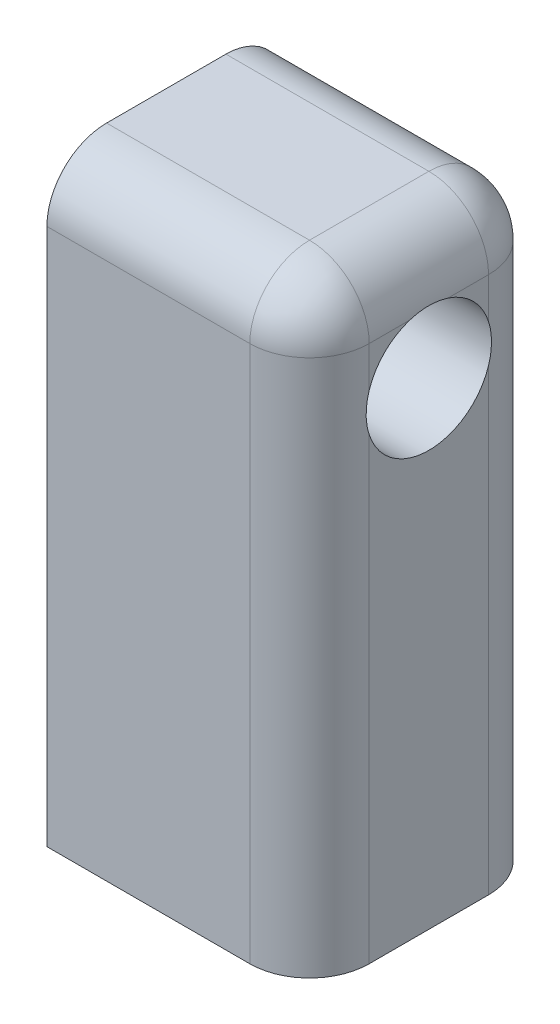
ISO-10303-21;
HEADER;
FILE_DESCRIPTION(('STEP AP214'),'2;1');
FILE_NAME('part.step','',(''),(''),'','','');
FILE_SCHEMA(('AUTOMOTIVE_DESIGN { 1 0 10303 214 1 1 1 1 }'));
ENDSEC;
DATA;
#1=APPLICATION_CONTEXT('core data for automotive mechanical design processes');
#2=APPLICATION_PROTOCOL_DEFINITION('international standard','automotive_design',2000,#1);
#3=PRODUCT_CONTEXT('',#1,'mechanical');
#4=PRODUCT('Part','Part','',(#3));
#5=PRODUCT_RELATED_PRODUCT_CATEGORY('part','',(#4));
#6=PRODUCT_DEFINITION_FORMATION('','',#4);
#7=PRODUCT_DEFINITION_CONTEXT('part definition',#1,'design');
#8=PRODUCT_DEFINITION('design','',#6,#7);
#9=PRODUCT_DEFINITION_SHAPE('','',#8);
#10=(LENGTH_UNIT() NAMED_UNIT(*) SI_UNIT(.MILLI.,.METRE.));
#11=(NAMED_UNIT(*) PLANE_ANGLE_UNIT() SI_UNIT($,.RADIAN.));
#12=(NAMED_UNIT(*) SI_UNIT($,.STERADIAN.) SOLID_ANGLE_UNIT());
#13=UNCERTAINTY_MEASURE_WITH_UNIT(LENGTH_MEASURE(1.E-05),#10,'distance_accuracy_value','');
#14=(GEOMETRIC_REPRESENTATION_CONTEXT(3) GLOBAL_UNCERTAINTY_ASSIGNED_CONTEXT((#13)) GLOBAL_UNIT_ASSIGNED_CONTEXT((#10,
#11,#12)) REPRESENTATION_CONTEXT('',''));
#15=CARTESIAN_POINT('',(0.,0.,0.));
#16=DIRECTION('',(0.,0.,1.));
#17=DIRECTION('',(1.,0.,0.));
#18=AXIS2_PLACEMENT_3D('',#15,#16,#17);
#19=CARTESIAN_POINT('',(4.4,10.,0.));
#20=DIRECTION('',(-1.,0.,0.));
#21=DIRECTION('',(0.,0.,1.));
#22=AXIS2_PLACEMENT_3D('',#19,#20,#21);
#23=PLANE('',#22);
#24=DIRECTION('',(0.,-1.,0.));
#25=VECTOR('',#24,1.);
#26=CARTESIAN_POINT('',(4.4,10.,-1.));
#27=LINE('',#26,#25);
#28=CARTESIAN_POINT('',(4.4,9.,-1.));
#29=VERTEX_POINT('',#28);
#30=CARTESIAN_POINT('',(4.4,8.32015621187164,-1.));
#31=VERTEX_POINT('',#30);
#32=EDGE_CURVE('E163',#29,#31,#27,.T.);
#33=ORIENTED_EDGE('',*,*,#32,.T.);
#34=CARTESIAN_POINT('',(4.4,8.,-2.));
#35=DIRECTION('',(1.,0.,0.));
#36=DIRECTION('',(0.,0.,-1.));
#37=AXIS2_PLACEMENT_3D('',#34,#35,#36);
#38=CIRCLE('',#37,1.05);
#39=CARTESIAN_POINT('',(4.4,9.,-1.67984378812836));
#40=VERTEX_POINT('',#39);
#41=EDGE_CURVE('E62',#40,#31,#38,.T.);
#42=ORIENTED_EDGE('',*,*,#41,.F.);
#43=DIRECTION('',(0.,0.,-1.));
#44=VECTOR('',#43,1.);
#45=CARTESIAN_POINT('',(4.4,9.,0.));
#46=LINE('',#45,#44);
#47=EDGE_CURVE('E160',#40,#29,#46,.F.);
#48=ORIENTED_EDGE('',*,*,#47,.T.);
#49=EDGE_LOOP('',(#33,#42,#48));
#50=FACE_BOUND('',#49,.T.);
#51=ADVANCED_FACE('F45',(#50),#23,.F.);
#52=CARTESIAN_POINT('',(4.4,9.,-3.));
#53=VERTEX_POINT('',#52);
#54=CARTESIAN_POINT('',(4.4,9.,-2.32015621187164));
#55=VERTEX_POINT('',#54);
#56=EDGE_CURVE('E148',#53,#55,#46,.F.);
#57=ORIENTED_EDGE('',*,*,#56,.T.);
#58=CARTESIAN_POINT('',(4.4,8.32015621187164,-3.));
#59=VERTEX_POINT('',#58);
#60=EDGE_CURVE('E133',#59,#55,#38,.T.);
#61=ORIENTED_EDGE('',*,*,#60,.F.);
#62=DIRECTION('',(0.,-1.,0.));
#63=VECTOR('',#62,1.);
#64=CARTESIAN_POINT('',(4.4,10.,-3.));
#65=LINE('',#64,#63);
#66=EDGE_CURVE('E49',#59,#53,#65,.F.);
#67=ORIENTED_EDGE('',*,*,#66,.T.);
#68=EDGE_LOOP('',(#57,#61,#67));
#69=FACE_BOUND('',#68,.T.);
#70=ADVANCED_FACE('F146',(#69),#23,.F.);
#71=CARTESIAN_POINT('',(0.,10.,0.));
#72=DIRECTION('',(1.,0.,0.));
#73=DIRECTION('',(0.,0.,-1.));
#74=AXIS2_PLACEMENT_3D('',#71,#72,#73);
#75=PLANE('',#74);
#76=CARTESIAN_POINT('',(0.,8.,-2.));
#77=DIRECTION('',(1.,0.,0.));
#78=DIRECTION('',(0.,0.,-1.));
#79=AXIS2_PLACEMENT_3D('',#76,#77,#78);
#80=CIRCLE('',#79,1.05);
#81=CARTESIAN_POINT('',(0.,8.,-3.05));
#82=VERTEX_POINT('',#81);
#83=EDGE_CURVE('E142',#82,#82,#80,.T.);
#84=ORIENTED_EDGE('',*,*,#83,.T.);
#85=EDGE_LOOP('',(#84));
#86=FACE_BOUND('',#85,.T.);
#87=DIRECTION('',(0.,-1.,0.));
#88=VECTOR('',#87,1.);
#89=CARTESIAN_POINT('',(0.,10.,0.));
#90=LINE('',#89,#88);
#91=CARTESIAN_POINT('',(0.,9.,0.));
#92=VERTEX_POINT('',#91);
#93=CARTESIAN_POINT('',(0.,0.,0.));
#94=VERTEX_POINT('',#93);
#95=EDGE_CURVE('E299',#92,#94,#90,.T.);
#96=ORIENTED_EDGE('',*,*,#95,.F.);
#97=CARTESIAN_POINT('',(0.,9.,-1.));
#98=DIRECTION('',(1.,0.,0.));
#99=DIRECTION('',(0.,0.,-1.));
#100=AXIS2_PLACEMENT_3D('',#97,#98,#99);
#101=CIRCLE('',#100,1.);
#102=CARTESIAN_POINT('',(0.,10.,-1.));
#103=VERTEX_POINT('',#102);
#104=EDGE_CURVE('E321',#92,#103,#101,.F.);
#105=ORIENTED_EDGE('',*,*,#104,.T.);
#106=DIRECTION('',(0.,0.,1.));
#107=VECTOR('',#106,1.);
#108=CARTESIAN_POINT('',(0.,10.,0.));
#109=LINE('',#108,#107);
#110=CARTESIAN_POINT('',(0.,10.,-3.));
#111=VERTEX_POINT('',#110);
#112=EDGE_CURVE('E277',#111,#103,#109,.T.);
#113=ORIENTED_EDGE('',*,*,#112,.F.);
#114=CARTESIAN_POINT('',(0.,9.,-3.));
#115=DIRECTION('',(1.,0.,0.));
#116=DIRECTION('',(0.,0.,-1.));
#117=AXIS2_PLACEMENT_3D('',#114,#115,#116);
#118=CIRCLE('',#117,1.);
#119=CARTESIAN_POINT('',(0.,9.,-4.));
#120=VERTEX_POINT('',#119);
#121=EDGE_CURVE('E318',#111,#120,#118,.F.);
#122=ORIENTED_EDGE('',*,*,#121,.T.);
#123=DIRECTION('',(0.,-1.,0.));
#124=VECTOR('',#123,1.);
#125=CARTESIAN_POINT('',(0.,10.,-4.));
#126=LINE('',#125,#124);
#127=CARTESIAN_POINT('',(0.,0.,-4.));
#128=VERTEX_POINT('',#127);
#129=EDGE_CURVE('E281',#120,#128,#126,.T.);
#130=ORIENTED_EDGE('',*,*,#129,.T.);
#131=DIRECTION('',(0.,0.,1.));
#132=VECTOR('',#131,1.);
#133=CARTESIAN_POINT('',(0.,0.,0.));
#134=LINE('',#133,#132);
#135=EDGE_CURVE('E271',#128,#94,#134,.T.);
#136=ORIENTED_EDGE('',*,*,#135,.T.);
#137=EDGE_LOOP('',(#96,#105,#113,#122,#130,#136));
#138=FACE_BOUND('',#137,.T.);
#139=ADVANCED_FACE('F381',(#86,#138),#75,.F.);
#140=CARTESIAN_POINT('',(0.,10.,0.));
#141=DIRECTION('',(0.,0.,-1.));
#142=DIRECTION('',(-1.,0.,0.));
#143=AXIS2_PLACEMENT_3D('',#140,#141,#142);
#144=PLANE('',#143);
#145=DIRECTION('',(0.,-1.,0.));
#146=VECTOR('',#145,1.);
#147=CARTESIAN_POINT('',(3.4,10.,0.));
#148=LINE('',#147,#146);
#149=CARTESIAN_POINT('',(3.4,0.,0.));
#150=VERTEX_POINT('',#149);
#151=CARTESIAN_POINT('',(3.4,9.,0.));
#152=VERTEX_POINT('',#151);
#153=EDGE_CURVE('E312',#150,#152,#148,.F.);
#154=ORIENTED_EDGE('',*,*,#153,.T.);
#155=DIRECTION('',(1.,0.,0.));
#156=VECTOR('',#155,1.);
#157=CARTESIAN_POINT('',(0.,9.,0.));
#158=LINE('',#157,#156);
#159=EDGE_CURVE('E315',#152,#92,#158,.F.);
#160=ORIENTED_EDGE('',*,*,#159,.T.);
#161=ORIENTED_EDGE('',*,*,#95,.T.);
#162=DIRECTION('',(1.,0.,0.));
#163=VECTOR('',#162,1.);
#164=CARTESIAN_POINT('',(0.,0.,0.));
#165=LINE('',#164,#163);
#166=EDGE_CURVE('E286',#94,#150,#165,.T.);
#167=ORIENTED_EDGE('',*,*,#166,.T.);
#168=EDGE_LOOP('',(#154,#160,#161,#167));
#169=FACE_BOUND('',#168,.T.);
#170=ADVANCED_FACE('F366',(#169),#144,.F.);
#171=CARTESIAN_POINT('',(4.4,0.,-3.));
#172=VERTEX_POINT('',#171);
#173=CARTESIAN_POINT('',(4.4,7.67984378812836,-3.));
#174=VERTEX_POINT('',#173);
#175=EDGE_CURVE('E156',#172,#174,#65,.F.);
#176=ORIENTED_EDGE('',*,*,#175,.T.);
#177=CARTESIAN_POINT('',(4.4,7.67984378812836,-1.));
#178=VERTEX_POINT('',#177);
#179=EDGE_CURVE('E136',#178,#174,#38,.T.);
#180=ORIENTED_EDGE('',*,*,#179,.F.);
#181=CARTESIAN_POINT('',(4.4,0.,-1.));
#182=VERTEX_POINT('',#181);
#183=EDGE_CURVE('E220',#178,#182,#27,.T.);
#184=ORIENTED_EDGE('',*,*,#183,.T.);
#185=DIRECTION('',(0.,0.,-1.));
#186=VECTOR('',#185,1.);
#187=CARTESIAN_POINT('',(4.4,0.,0.));
#188=LINE('',#187,#186);
#189=EDGE_CURVE('E290',#182,#172,#188,.T.);
#190=ORIENTED_EDGE('',*,*,#189,.T.);
#191=EDGE_LOOP('',(#176,#180,#184,#190));
#192=FACE_BOUND('',#191,.T.);
#193=ADVANCED_FACE('F390',(#192),#23,.F.);
#194=CARTESIAN_POINT('',(0.,10.,-4.));
#195=DIRECTION('',(0.,0.,1.));
#196=DIRECTION('',(1.,0.,0.));
#197=AXIS2_PLACEMENT_3D('',#194,#195,#196);
#198=PLANE('',#197);
#199=ORIENTED_EDGE('',*,*,#129,.F.);
#200=DIRECTION('',(-1.,0.,0.));
#201=VECTOR('',#200,1.);
#202=CARTESIAN_POINT('',(0.,9.,-4.));
#203=LINE('',#202,#201);
#204=CARTESIAN_POINT('',(3.4,9.,-4.));
#205=VERTEX_POINT('',#204);
#206=EDGE_CURVE('E222',#120,#205,#203,.F.);
#207=ORIENTED_EDGE('',*,*,#206,.T.);
#208=DIRECTION('',(0.,-1.,0.));
#209=VECTOR('',#208,1.);
#210=CARTESIAN_POINT('',(3.4,10.,-4.));
#211=LINE('',#210,#209);
#212=CARTESIAN_POINT('',(3.4,0.,-4.));
#213=VERTEX_POINT('',#212);
#214=EDGE_CURVE('E324',#205,#213,#211,.T.);
#215=ORIENTED_EDGE('',*,*,#214,.T.);
#216=DIRECTION('',(-1.,0.,0.));
#217=VECTOR('',#216,1.);
#218=CARTESIAN_POINT('',(0.,0.,-4.));
#219=LINE('',#218,#217);
#220=EDGE_CURVE('E282',#213,#128,#219,.T.);
#221=ORIENTED_EDGE('',*,*,#220,.T.);
#222=EDGE_LOOP('',(#199,#207,#215,#221));
#223=FACE_BOUND('',#222,.T.);
#224=ADVANCED_FACE('F330',(#223),#198,.F.);
#225=CARTESIAN_POINT('',(0.,10.,0.));
#226=DIRECTION('',(0.,-1.,0.));
#227=DIRECTION('',(0.,0.,-1.));
#228=AXIS2_PLACEMENT_3D('',#225,#226,#227);
#229=PLANE('',#228);
#230=ORIENTED_EDGE('',*,*,#112,.T.);
#231=DIRECTION('',(1.,0.,0.));
#232=VECTOR('',#231,1.);
#233=CARTESIAN_POINT('',(0.,10.,-1.));
#234=LINE('',#233,#232);
#235=CARTESIAN_POINT('',(3.4,10.,-1.));
#236=VERTEX_POINT('',#235);
#237=EDGE_CURVE('E308',#103,#236,#234,.T.);
#238=ORIENTED_EDGE('',*,*,#237,.T.);
#239=DIRECTION('',(0.,0.,-1.));
#240=VECTOR('',#239,1.);
#241=CARTESIAN_POINT('',(3.4,10.,0.));
#242=LINE('',#241,#240);
#243=CARTESIAN_POINT('',(3.4,10.,-3.));
#244=VERTEX_POINT('',#243);
#245=EDGE_CURVE('E302',#236,#244,#242,.T.);
#246=ORIENTED_EDGE('',*,*,#245,.T.);
#247=DIRECTION('',(-1.,0.,0.));
#248=VECTOR('',#247,1.);
#249=CARTESIAN_POINT('',(0.,10.,-3.));
#250=LINE('',#249,#248);
#251=EDGE_CURVE('E305',#244,#111,#250,.T.);
#252=ORIENTED_EDGE('',*,*,#251,.T.);
#253=EDGE_LOOP('',(#230,#238,#246,#252));
#254=FACE_BOUND('',#253,.T.);
#255=ADVANCED_FACE('F378',(#254),#229,.F.);
#256=CARTESIAN_POINT('',(0.,0.,0.));
#257=DIRECTION('',(0.,-1.,0.));
#258=DIRECTION('',(0.,0.,-1.));
#259=AXIS2_PLACEMENT_3D('',#256,#257,#258);
#260=PLANE('',#259);
#261=CARTESIAN_POINT('',(2.4,0.,-2.));
#262=DIRECTION('',(0.,-1.,0.));
#263=DIRECTION('',(0.,0.,-1.));
#264=AXIS2_PLACEMENT_3D('',#261,#262,#263);
#265=CIRCLE('',#264,0.925);
#266=CARTESIAN_POINT('',(2.4,0.,-2.925));
#267=VERTEX_POINT('',#266);
#268=EDGE_CURVE('E272',#267,#267,#265,.T.);
#269=ORIENTED_EDGE('',*,*,#268,.F.);
#270=EDGE_LOOP('',(#269));
#271=FACE_BOUND('',#270,.T.);
#272=ORIENTED_EDGE('',*,*,#220,.F.);
#273=CARTESIAN_POINT('',(3.4,0.,-3.));
#274=DIRECTION('',(0.,-1.,0.));
#275=DIRECTION('',(0.,0.,-1.));
#276=AXIS2_PLACEMENT_3D('',#273,#274,#275);
#277=CIRCLE('',#276,1.);
#278=EDGE_CURVE('E56',#213,#172,#277,.T.);
#279=ORIENTED_EDGE('',*,*,#278,.T.);
#280=ORIENTED_EDGE('',*,*,#189,.F.);
#281=CARTESIAN_POINT('',(3.4,0.,-1.));
#282=DIRECTION('',(0.,-1.,0.));
#283=DIRECTION('',(0.,0.,-1.));
#284=AXIS2_PLACEMENT_3D('',#281,#282,#283);
#285=CIRCLE('',#284,1.);
#286=EDGE_CURVE('E159',#182,#150,#285,.T.);
#287=ORIENTED_EDGE('',*,*,#286,.T.);
#288=ORIENTED_EDGE('',*,*,#166,.F.);
#289=ORIENTED_EDGE('',*,*,#135,.F.);
#290=EDGE_LOOP('',(#272,#279,#280,#287,#288,#289));
#291=FACE_BOUND('',#290,.T.);
#292=ADVANCED_FACE('F361',(#271,#291),#260,.T.);
#293=CARTESIAN_POINT('',(2.4,6.,-2.));
#294=DIRECTION('',(0.,-1.,0.));
#295=DIRECTION('',(0.,0.,-1.));
#296=AXIS2_PLACEMENT_3D('',#293,#294,#295);
#297=CYLINDRICAL_SURFACE('',#296,0.925);
#298=CARTESIAN_POINT('',(2.4,6.,-2.));
#299=DIRECTION('',(0.,-1.,0.));
#300=DIRECTION('',(0.,0.,-1.));
#301=AXIS2_PLACEMENT_3D('',#298,#299,#300);
#302=CIRCLE('',#301,0.925);
#303=CARTESIAN_POINT('',(2.4,6.,-2.925));
#304=VERTEX_POINT('',#303);
#305=EDGE_CURVE('E262',#304,#304,#302,.T.);
#306=ORIENTED_EDGE('',*,*,#305,.F.);
#307=EDGE_LOOP('',(#306));
#308=FACE_BOUND('',#307,.T.);
#309=ORIENTED_EDGE('',*,*,#268,.T.);
#310=EDGE_LOOP('',(#309));
#311=FACE_BOUND('',#310,.T.);
#312=ADVANCED_FACE('F410',(#308,#311),#297,.F.);
#313=CARTESIAN_POINT('',(2.4,6.,-2.));
#314=DIRECTION('',(0.,-1.,0.));
#315=DIRECTION('',(0.,0.,-1.));
#316=AXIS2_PLACEMENT_3D('',#313,#314,#315);
#317=PLANE('',#316);
#318=ORIENTED_EDGE('',*,*,#305,.T.);
#319=EDGE_LOOP('',(#318));
#320=FACE_BOUND('',#319,.T.);
#321=ADVANCED_FACE('F253',(#320),#317,.T.);
#322=CARTESIAN_POINT('',(0.,9.,-3.));
#323=DIRECTION('',(-1.,0.,0.));
#324=DIRECTION('',(0.,0.,1.));
#325=AXIS2_PLACEMENT_3D('',#322,#323,#324);
#326=CYLINDRICAL_SURFACE('',#325,1.);
#327=ORIENTED_EDGE('',*,*,#121,.F.);
#328=ORIENTED_EDGE('',*,*,#251,.F.);
#329=CARTESIAN_POINT('',(3.4,9.,-3.));
#330=DIRECTION('',(1.,0.,0.));
#331=DIRECTION('',(0.,0.,-1.));
#332=AXIS2_PLACEMENT_3D('',#329,#330,#331);
#333=CIRCLE('',#332,1.);
#334=EDGE_CURVE('E276',#205,#244,#333,.T.);
#335=ORIENTED_EDGE('',*,*,#334,.F.);
#336=ORIENTED_EDGE('',*,*,#206,.F.);
#337=EDGE_LOOP('',(#327,#328,#335,#336));
#338=FACE_BOUND('',#337,.T.);
#339=ADVANCED_FACE('F47',(#338),#326,.T.);
#340=CARTESIAN_POINT('',(3.4,10.,-3.));
#341=DIRECTION('',(0.,-1.,0.));
#342=DIRECTION('',(0.,0.,-1.));
#343=AXIS2_PLACEMENT_3D('',#340,#341,#342);
#344=CYLINDRICAL_SURFACE('',#343,1.);
#345=CARTESIAN_POINT('',(4.4,7.67984378812836,-3.));
#346=CARTESIAN_POINT('',(4.40000075162093,7.69702340121931,-3.00550062855235));
#347=CARTESIAN_POINT('',(4.39998879456515,7.71434499226633,-3.01055769944852));
#348=CARTESIAN_POINT('',(4.39994171803689,7.7492256066431,-3.01977318433491));
#349=CARTESIAN_POINT('',(4.3999065985262,7.76678463036436,-3.02393159684313));
#350=CARTESIAN_POINT('',(4.39981545188692,7.80209358771909,-3.03133821735586));
#351=CARTESIAN_POINT('',(4.39975942468936,7.81984352198205,-3.03458642235826));
#352=CARTESIAN_POINT('',(4.39961518872155,7.85548724616372,-3.04016413852537));
#353=CARTESIAN_POINT('',(4.3995269797921,7.8733810367937,-3.04249364514493));
#354=CARTESIAN_POINT('',(4.3993612219149,7.90926450607298,-3.04622774363928));
#355=CARTESIAN_POINT('',(4.39928367303749,7.927254185354,-3.04763232941291));
#356=CARTESIAN_POINT('',(4.39897914172843,7.96328336085802,-3.04951286613508));
#357=CARTESIAN_POINT('',(4.39875215806467,7.98132285749054,-3.04998880942664));
#358=CARTESIAN_POINT('',(4.3987491928767,7.99957335699856,-3.04999993501578));
#359=CARTESIAN_POINT('',(4.39874918955688,7.99978667832031,-3.05000000002419));
#360=CARTESIAN_POINT('',(4.39875158875753,8.01792593740084,-3.04999999796764));
#361=CARTESIAN_POINT('',(4.3989766420919,8.03585440235664,-3.04954077164454));
#362=CARTESIAN_POINT('',(4.39928104563043,8.07186327120699,-3.04769477636623));
#363=CARTESIAN_POINT('',(4.39935873978012,8.08994313456797,-3.04629770119169));
#364=CARTESIAN_POINT('',(4.39952504175251,8.12599453371164,-3.04257063443976));
#365=CARTESIAN_POINT('',(4.39961364215376,8.14396613452494,-3.04024127485714));
#366=CARTESIAN_POINT('',(4.39975846768589,8.17975266699275,-3.03465779200315));
#367=CARTESIAN_POINT('',(4.39981471464817,8.19756769628642,-3.03140429453974));
#368=CARTESIAN_POINT('',(4.39990621394466,8.23299381584308,-3.02398296447434));
#369=CARTESIAN_POINT('',(4.39994148041174,8.25060503553726,-3.01981574996574));
#370=CARTESIAN_POINT('',(4.39998874353837,8.28557700681027,-3.0105804717775));
#371=CARTESIAN_POINT('',(4.40000075584696,8.30293791902085,-3.00551301643005));
#372=CARTESIAN_POINT('',(4.4,8.32015621187164,-3.));
#373=B_SPLINE_CURVE_WITH_KNOTS('',3,(#345,#346,#347,#348,#349,#350,#351,#352,#353,#354,#355,
#356,#357,#358,#359,#360,#361,#362,#363,#364,#365,#366,#367,#368,#369,#370,#371,#372),
.UNSPECIFIED.,.F.,.F.,(4,2,2,2,2,2,2,2,2,2,2,2,2,4),(0.,0.0541101730234471,0.108220435281005,
0.162330876006635,0.216441584433422,0.270552649793117,0.324664161315715,0.325304125993025,
0.379081907796743,0.433460555408462,0.487802402052646,0.542107536844229,0.596376049079051,
0.650608028233898),.UNSPECIFIED.);
#374=EDGE_CURVE('E129',#174,#59,#373,.T.);
#375=ORIENTED_EDGE('',*,*,#374,.F.);
#376=ORIENTED_EDGE('',*,*,#175,.F.);
#377=ORIENTED_EDGE('',*,*,#278,.F.);
#378=ORIENTED_EDGE('',*,*,#214,.F.);
#379=CARTESIAN_POINT('',(3.4,9.,-3.));
#380=DIRECTION('',(0.,1.,0.));
#381=DIRECTION('',(0.,0.,1.));
#382=AXIS2_PLACEMENT_3D('',#379,#380,#381);
#383=CIRCLE('',#382,1.);
#384=EDGE_CURVE('E153',#53,#205,#383,.T.);
#385=ORIENTED_EDGE('',*,*,#384,.F.);
#386=ORIENTED_EDGE('',*,*,#66,.F.);
#387=EDGE_LOOP('',(#375,#376,#377,#378,#385,#386));
#388=FACE_BOUND('',#387,.T.);
#389=ADVANCED_FACE('F150',(#388),#344,.T.);
#390=CARTESIAN_POINT('',(3.4,9.,-3.));
#391=DIRECTION('',(0.,0.,-1.));
#392=DIRECTION('',(-1.,0.,0.));
#393=AXIS2_PLACEMENT_3D('',#390,#391,#392);
#394=SPHERICAL_SURFACE('',#393,1.);
#395=ORIENTED_EDGE('',*,*,#384,.T.);
#396=ORIENTED_EDGE('',*,*,#334,.T.);
#397=CARTESIAN_POINT('',(3.4,9.,-3.));
#398=DIRECTION('',(0.,0.,-1.));
#399=DIRECTION('',(-1.,0.,0.));
#400=AXIS2_PLACEMENT_3D('',#397,#398,#399);
#401=CIRCLE('',#400,1.);
#402=EDGE_CURVE('E339',#53,#244,#401,.F.);
#403=ORIENTED_EDGE('',*,*,#402,.F.);
#404=EDGE_LOOP('',(#395,#396,#403));
#405=FACE_BOUND('',#404,.T.);
#406=ADVANCED_FACE('F191',(#405),#394,.T.);
#407=CARTESIAN_POINT('',(3.4,9.,0.));
#408=DIRECTION('',(0.,0.,-1.));
#409=DIRECTION('',(-1.,0.,0.));
#410=AXIS2_PLACEMENT_3D('',#407,#408,#409);
#411=CYLINDRICAL_SURFACE('',#410,1.);
#412=CARTESIAN_POINT('',(4.4,9.,-2.32015621187164));
#413=CARTESIAN_POINT('',(4.400000356422,9.00550062865328,-2.30297659320139));
#414=CARTESIAN_POINT('',(4.39998859696553,9.01055769949898,-2.28565500494401));
#415=CARTESIAN_POINT('',(4.39994191563684,9.01977318428445,-2.25077439614655));
#416=CARTESIAN_POINT('',(4.39990699372643,9.02393159674221,-2.23321537521496));
#417=CARTESIAN_POINT('',(4.39981505668538,9.03133821745678,-2.19790640670157));
#418=CARTESIAN_POINT('',(4.39975804148187,9.03458642271149,-2.18015645849026));
#419=CARTESIAN_POINT('',(4.39961657193589,9.04016413817214,-2.14451277336407));
#420=CARTESIAN_POINT('',(4.39953211745768,9.04249364383292,-2.12661903573826));
#421=CARTESIAN_POINT('',(4.39935608421543,9.0462277449513,-2.09073542139458));
#422=CARTESIAN_POINT('',(4.39926450540442,9.04763233430777,-2.07274554404332));
#423=CARTESIAN_POINT('',(4.39899830951956,9.04951286124018,-2.03671690974689));
#424=CARTESIAN_POINT('',(4.39882369176104,9.049988791159,-2.01867815239991));
#425=CARTESIAN_POINT('',(4.3987064547379,9.05000613139,-1.99027869726608));
#426=CARTESIAN_POINT('',(4.39869672697642,9.04985906162558,-1.97991761781884));
#427=CARTESIAN_POINT('',(4.39872103879274,9.04932414658147,-1.96147340769085));
#428=CARTESIAN_POINT('',(4.39874595681774,9.04899610838228,-1.95338850901488));
#429=CARTESIAN_POINT('',(4.39880910584405,9.0480521625191,-1.93529072225212));
#430=CARTESIAN_POINT('',(4.39884909641611,9.04738608669026,-1.92528042543687));
#431=CARTESIAN_POINT('',(4.3989462467048,9.04561078731934,-1.90334906965416));
#432=CARTESIAN_POINT('',(4.39900523116932,9.04444076988077,-1.89143291895279));
#433=CARTESIAN_POINT('',(4.39914113678653,9.04147127174611,-1.86571997634765));
#434=CARTESIAN_POINT('',(4.39921941562227,9.03960050860991,-1.85193136935018));
#435=CARTESIAN_POINT('',(4.39937055175542,9.03549062699124,-1.82558124716581));
#436=CARTESIAN_POINT('',(4.3994433194155,9.03329500214146,-1.81301292385219));
#437=CARTESIAN_POINT('',(4.39957397454401,9.02872906199116,-1.7894207817721));
#438=CARTESIAN_POINT('',(4.39963260842851,9.02640873282141,-1.77838727663807));
#439=CARTESIAN_POINT('',(4.39973631819614,9.0217425289482,-1.75784704126766));
#440=CARTESIAN_POINT('',(4.39978216293598,9.01944017422955,-1.74833041437804));
#441=CARTESIAN_POINT('',(4.39986054234966,9.01493911290097,-1.73080192831597));
#442=CARTESIAN_POINT('',(4.39989404126334,9.01277754294321,-1.72278051350519));
#443=CARTESIAN_POINT('',(4.39996301090006,9.00721691001436,-1.70307899991017));
#444=CARTESIAN_POINT('',(4.39999217519352,9.00370926972398,-1.69142944242584));
#445=CARTESIAN_POINT('',(4.4,9.,-1.67984378812836));
#446=B_SPLINE_CURVE_WITH_KNOTS('',3,(#412,#413,#414,#415,#416,#417,#418,#419,#420,#421,#422,
#423,#424,#425,#426,#427,#428,#429,#430,#431,#432,#433,#434,#435,#436,#437,#438,#439,#440,#441,
#442,#443,#444,#445),.UNSPECIFIED.,.F.,.F.,(4,2,2,2,2,2,2,2,2,2,2,2,2,2,2,2,4),(0.,
0.0541101730234466,0.108220435281004,0.162330876006635,0.216441584433419,0.270552649793115,
0.324664161315712,0.355746210521293,0.380018884493712,0.410112255190406,0.446026127635855,
0.487760246972359,0.526028439764395,0.559847589078903,0.589217550703191,0.614138204474357,
0.650629885092422),.UNSPECIFIED.);
#447=EDGE_CURVE('E143',#55,#40,#446,.T.);
#448=ORIENTED_EDGE('',*,*,#447,.F.);
#449=ORIENTED_EDGE('',*,*,#56,.F.);
#450=ORIENTED_EDGE('',*,*,#402,.T.);
#451=ORIENTED_EDGE('',*,*,#245,.F.);
#452=CARTESIAN_POINT('',(3.4,9.,-1.));
#453=DIRECTION('',(0.,0.,1.));
#454=DIRECTION('',(1.,0.,0.));
#455=AXIS2_PLACEMENT_3D('',#452,#453,#454);
#456=CIRCLE('',#455,1.);
#457=EDGE_CURVE('E343',#29,#236,#456,.T.);
#458=ORIENTED_EDGE('',*,*,#457,.F.);
#459=ORIENTED_EDGE('',*,*,#47,.F.);
#460=EDGE_LOOP('',(#448,#449,#450,#451,#458,#459));
#461=FACE_BOUND('',#460,.T.);
#462=ADVANCED_FACE('F193',(#461),#411,.T.);
#463=CARTESIAN_POINT('',(3.4,10.,-1.));
#464=DIRECTION('',(0.,-1.,0.));
#465=DIRECTION('',(0.,0.,-1.));
#466=AXIS2_PLACEMENT_3D('',#463,#464,#465);
#467=CYLINDRICAL_SURFACE('',#466,1.);
#468=CARTESIAN_POINT('',(4.4,8.32015621187164,-1.));
#469=CARTESIAN_POINT('',(4.400000356422,8.30297659320139,-0.994499371346725));
#470=CARTESIAN_POINT('',(4.39998859696553,8.28565500494402,-0.989442300501022));
#471=CARTESIAN_POINT('',(4.39994191563684,8.25077439614655,-0.980226815715551));
#472=CARTESIAN_POINT('',(4.39990699372643,8.23321537521496,-0.97606840325779));
#473=CARTESIAN_POINT('',(4.39981505668538,8.19790640670158,-0.968661782543215));
#474=CARTESIAN_POINT('',(4.39975804148187,8.18015645849026,-0.965413577288508));
#475=CARTESIAN_POINT('',(4.39961657193589,8.14451277336407,-0.959835861827865));
#476=CARTESIAN_POINT('',(4.39953211745768,8.12661903573826,-0.957506356167079));
#477=CARTESIAN_POINT('',(4.39935608421543,8.09073542139458,-0.953772255048697));
#478=CARTESIAN_POINT('',(4.39926450540442,8.07274554404332,-0.95236766569223));
#479=CARTESIAN_POINT('',(4.39899830951956,8.03671690974689,-0.950487138759822));
#480=CARTESIAN_POINT('',(4.39882369176104,8.01867815239991,-0.950011208841004));
#481=CARTESIAN_POINT('',(4.3987064547379,7.99027869726608,-0.94999386861));
#482=CARTESIAN_POINT('',(4.39869672697642,7.97991761781884,-0.950140938374419));
#483=CARTESIAN_POINT('',(4.39872103879274,7.96147340769085,-0.950675853418532));
#484=CARTESIAN_POINT('',(4.39874595681774,7.95338850901488,-0.951003891617725));
#485=CARTESIAN_POINT('',(4.39880910584405,7.93529072225211,-0.9519478374809));
#486=CARTESIAN_POINT('',(4.39884909641611,7.92528042543687,-0.952613913309743));
#487=CARTESIAN_POINT('',(4.3989462467048,7.90334906965415,-0.954389212680659));
#488=CARTESIAN_POINT('',(4.39900523116932,7.89143291895279,-0.955559230119231));
#489=CARTESIAN_POINT('',(4.39914113678653,7.86571997634765,-0.95852872825389));
#490=CARTESIAN_POINT('',(4.39921941562227,7.85193136935018,-0.960399491390093));
#491=CARTESIAN_POINT('',(4.39937055175542,7.82558124716581,-0.964509373008761));
#492=CARTESIAN_POINT('',(4.3994433194155,7.81301292385219,-0.96670499785854));
#493=CARTESIAN_POINT('',(4.39957397454401,7.7894207817721,-0.971270938008837));
#494=CARTESIAN_POINT('',(4.39963260842851,7.77838727663807,-0.973591267178586));
#495=CARTESIAN_POINT('',(4.39973631819614,7.75784704126766,-0.978257471051804));
#496=CARTESIAN_POINT('',(4.39978216293598,7.74833041437804,-0.980559825770454));
#497=CARTESIAN_POINT('',(4.39986054234966,7.73080192831597,-0.985060887099027));
#498=CARTESIAN_POINT('',(4.39989404126334,7.72278051350519,-0.987222457056789));
#499=CARTESIAN_POINT('',(4.39996301090006,7.70307899991017,-0.992783089985634));
#500=CARTESIAN_POINT('',(4.39999217519352,7.69142944242584,-0.996290730276022));
#501=CARTESIAN_POINT('',(4.4,7.67984378812836,-1.));
#502=B_SPLINE_CURVE_WITH_KNOTS('',3,(#468,#469,#470,#471,#472,#473,#474,#475,#476,#477,#478,
#479,#480,#481,#482,#483,#484,#485,#486,#487,#488,#489,#490,#491,#492,#493,#494,#495,#496,#497,
#498,#499,#500,#501),.UNSPECIFIED.,.F.,.F.,(4,2,2,2,2,2,2,2,2,2,2,2,2,2,2,2,4),(0.,
0.0541101730234471,0.108220435281004,0.162330876006636,0.216441584433421,0.270552649793116,
0.324664161315714,0.355746210521296,0.380018884493716,0.410112255190409,0.446026127635858,
0.487760246972363,0.526028439764396,0.559847589078904,0.589217550703193,0.614138204474359,
0.650629885092427),.UNSPECIFIED.);
#503=EDGE_CURVE('E11',#31,#178,#502,.T.);
#504=ORIENTED_EDGE('',*,*,#503,.F.);
#505=ORIENTED_EDGE('',*,*,#32,.F.);
#506=CARTESIAN_POINT('',(3.4,9.,-1.));
#507=DIRECTION('',(0.,1.,0.));
#508=DIRECTION('',(0.,0.,1.));
#509=AXIS2_PLACEMENT_3D('',#506,#507,#508);
#510=CIRCLE('',#509,1.);
#511=EDGE_CURVE('E349',#152,#29,#510,.T.);
#512=ORIENTED_EDGE('',*,*,#511,.F.);
#513=ORIENTED_EDGE('',*,*,#153,.F.);
#514=ORIENTED_EDGE('',*,*,#286,.F.);
#515=ORIENTED_EDGE('',*,*,#183,.F.);
#516=EDGE_LOOP('',(#504,#505,#512,#513,#514,#515));
#517=FACE_BOUND('',#516,.T.);
#518=ADVANCED_FACE('F198',(#517),#467,.T.);
#519=CARTESIAN_POINT('',(3.4,9.,-1.));
#520=DIRECTION('',(1.,0.,0.));
#521=DIRECTION('',(0.,0.,-1.));
#522=AXIS2_PLACEMENT_3D('',#519,#520,#521);
#523=SPHERICAL_SURFACE('',#522,1.);
#524=ORIENTED_EDGE('',*,*,#511,.T.);
#525=ORIENTED_EDGE('',*,*,#457,.T.);
#526=CARTESIAN_POINT('',(3.4,9.,-1.));
#527=DIRECTION('',(1.,0.,0.));
#528=DIRECTION('',(0.,0.,-1.));
#529=AXIS2_PLACEMENT_3D('',#526,#527,#528);
#530=CIRCLE('',#529,1.);
#531=EDGE_CURVE('E353',#152,#236,#530,.F.);
#532=ORIENTED_EDGE('',*,*,#531,.F.);
#533=EDGE_LOOP('',(#524,#525,#532));
#534=FACE_BOUND('',#533,.T.);
#535=ADVANCED_FACE('F203',(#534),#523,.T.);
#536=CARTESIAN_POINT('',(0.,9.,-1.));
#537=DIRECTION('',(1.,0.,0.));
#538=DIRECTION('',(0.,0.,-1.));
#539=AXIS2_PLACEMENT_3D('',#536,#537,#538);
#540=CYLINDRICAL_SURFACE('',#539,1.);
#541=ORIENTED_EDGE('',*,*,#104,.F.);
#542=ORIENTED_EDGE('',*,*,#159,.F.);
#543=ORIENTED_EDGE('',*,*,#531,.T.);
#544=ORIENTED_EDGE('',*,*,#237,.F.);
#545=EDGE_LOOP('',(#541,#542,#543,#544));
#546=FACE_BOUND('',#545,.T.);
#547=ADVANCED_FACE('F252',(#546),#540,.T.);
#548=CARTESIAN_POINT('',(-5.6,8.,-2.));
#549=DIRECTION('',(1.,0.,0.));
#550=DIRECTION('',(0.,0.,-1.));
#551=AXIS2_PLACEMENT_3D('',#548,#549,#550);
#552=CYLINDRICAL_SURFACE('',#551,1.05);
#553=ORIENTED_EDGE('',*,*,#374,.T.);
#554=ORIENTED_EDGE('',*,*,#60,.T.);
#555=ORIENTED_EDGE('',*,*,#447,.T.);
#556=ORIENTED_EDGE('',*,*,#41,.T.);
#557=ORIENTED_EDGE('',*,*,#503,.T.);
#558=ORIENTED_EDGE('',*,*,#179,.T.);
#559=EDGE_LOOP('',(#553,#554,#555,#556,#557,#558));
#560=FACE_BOUND('',#559,.T.);
#561=ORIENTED_EDGE('',*,*,#83,.F.);
#562=EDGE_LOOP('',(#561));
#563=FACE_BOUND('',#562,.T.);
#564=ADVANCED_FACE('F131',(#560,#563),#552,.F.);
#565=CLOSED_SHELL('',(#51,#70,#139,#170,#193,#224,#255,#292,#312,#321,#339,#389,#406,#462,#518,
#535,#547,#564));
#566=MANIFOLD_SOLID_BREP('B2',#565);
#567=ADVANCED_BREP_SHAPE_REPRESENTATION('',(#18,#566),#14);
#568=SHAPE_DEFINITION_REPRESENTATION(#9,#567);
ENDSEC;
END-ISO-10303-21;
